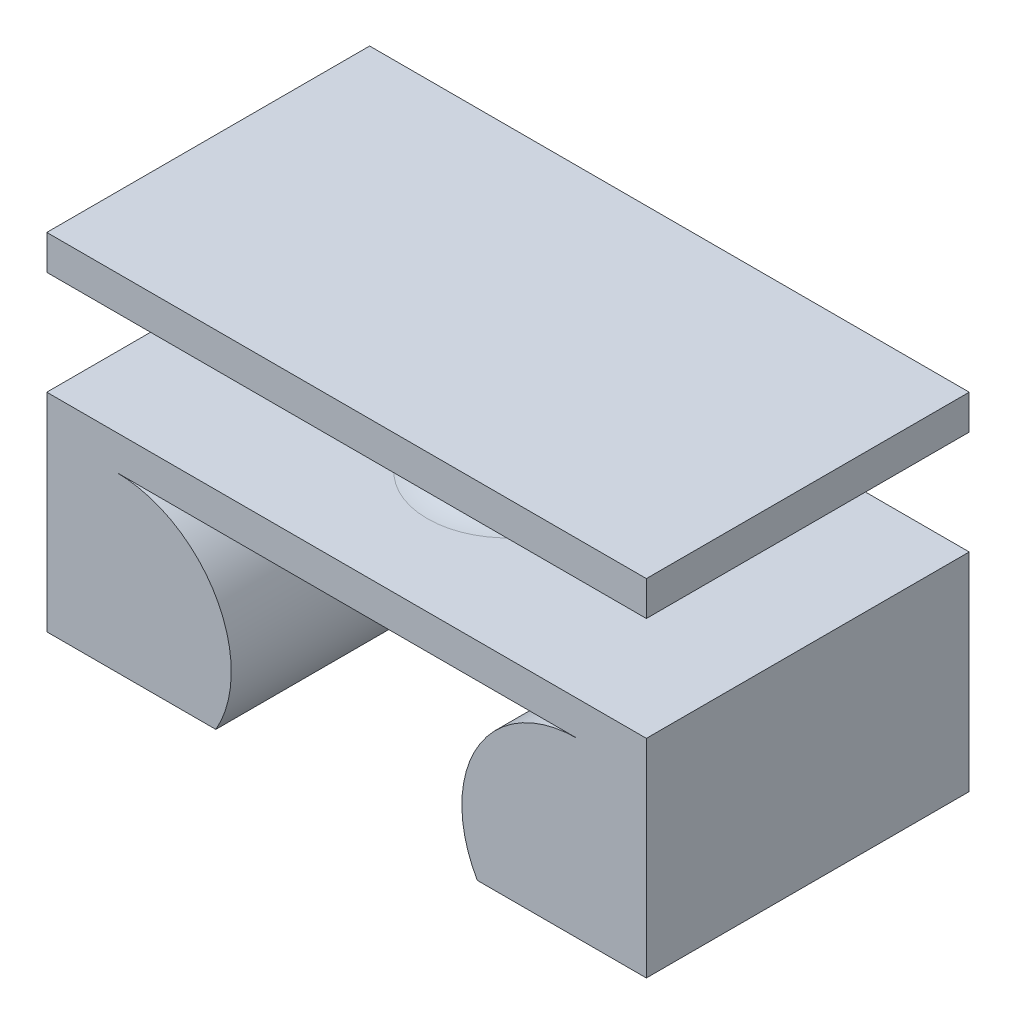
ISO-10303-21;
HEADER;
FILE_DESCRIPTION(('STEP AP214'),'2;1');
FILE_NAME('part.step','',(''),(''),'','','');
FILE_SCHEMA(('AUTOMOTIVE_DESIGN { 1 0 10303 214 1 1 1 1 }'));
ENDSEC;
DATA;
#1=APPLICATION_CONTEXT('core data for automotive mechanical design processes');
#2=APPLICATION_PROTOCOL_DEFINITION('international standard','automotive_design',2000,#1);
#3=PRODUCT_CONTEXT('',#1,'mechanical');
#4=PRODUCT('Part','Part','',(#3));
#5=PRODUCT_RELATED_PRODUCT_CATEGORY('part','',(#4));
#6=PRODUCT_DEFINITION_FORMATION('','',#4);
#7=PRODUCT_DEFINITION_CONTEXT('part definition',#1,'design');
#8=PRODUCT_DEFINITION('design','',#6,#7);
#9=PRODUCT_DEFINITION_SHAPE('','',#8);
#10=(LENGTH_UNIT() NAMED_UNIT(*) SI_UNIT(.MILLI.,.METRE.));
#11=(NAMED_UNIT(*) PLANE_ANGLE_UNIT() SI_UNIT($,.RADIAN.));
#12=(NAMED_UNIT(*) SI_UNIT($,.STERADIAN.) SOLID_ANGLE_UNIT());
#13=UNCERTAINTY_MEASURE_WITH_UNIT(LENGTH_MEASURE(1.E-05),#10,'distance_accuracy_value','');
#14=(GEOMETRIC_REPRESENTATION_CONTEXT(3) GLOBAL_UNCERTAINTY_ASSIGNED_CONTEXT((#13)) GLOBAL_UNIT_ASSIGNED_CONTEXT((#10,
#11,#12)) REPRESENTATION_CONTEXT('',''));
#15=CARTESIAN_POINT('',(0.,0.,0.));
#16=DIRECTION('',(0.,0.,1.));
#17=DIRECTION('',(1.,0.,0.));
#18=AXIS2_PLACEMENT_3D('',#15,#16,#17);
#19=CARTESIAN_POINT('',(5.00000000000001,-0.999999999999966,3.5));
#20=DIRECTION('',(0.,0.,-1.));
#21=DIRECTION('',(-1.,0.,0.));
#22=AXIS2_PLACEMENT_3D('',#19,#20,#21);
#23=CYLINDRICAL_SURFACE('',#22,2.49999999999998);
#24=CARTESIAN_POINT('',(5.00000000000001,-0.999999999999983,-5.));
#25=DIRECTION('',(-0.707106781186547,0.,-0.707106781186547));
#26=DIRECTION('',(0.707106781186547,0.,-0.707106781186547));
#27=AXIS2_PLACEMENT_3D('',#24,#25,#26);
#28=ELLIPSE('',#27,3.53553390593272,2.49999999999999);
#29=CARTESIAN_POINT('',(2.83493649053895,-2.25,-2.8349364905389));
#30=VERTEX_POINT('',#29);
#31=CARTESIAN_POINT('',(3.5,0.999999999999999,-3.5));
#32=VERTEX_POINT('',#31);
#33=EDGE_CURVE('E57',#30,#32,#28,.T.);
#34=ORIENTED_EDGE('',*,*,#33,.F.);
#35=DIRECTION('',(0.,0.,-1.));
#36=VECTOR('',#35,1.);
#37=CARTESIAN_POINT('',(2.83493649053895,-2.25,3.5));
#38=LINE('',#37,#36);
#39=CARTESIAN_POINT('',(2.83493649053895,-2.25,3.5));
#40=VERTEX_POINT('',#39);
#41=EDGE_CURVE('E50',#40,#30,#38,.T.);
#42=ORIENTED_EDGE('',*,*,#41,.F.);
#43=CARTESIAN_POINT('',(5.00000000000001,-0.999999999999966,3.5));
#44=DIRECTION('',(0.,0.,1.));
#45=DIRECTION('',(1.,0.,0.));
#46=AXIS2_PLACEMENT_3D('',#43,#44,#45);
#47=CIRCLE('',#46,2.49999999999998);
#48=CARTESIAN_POINT('',(5.,1.5,3.5));
#49=VERTEX_POINT('',#48);
#50=EDGE_CURVE('E178',#40,#49,#47,.F.);
#51=ORIENTED_EDGE('',*,*,#50,.T.);
#52=DIRECTION('',(0.,0.,-1.));
#53=VECTOR('',#52,1.);
#54=CARTESIAN_POINT('',(5.,1.5,3.5));
#55=LINE('',#54,#53);
#56=CARTESIAN_POINT('',(5.,1.5,-3.5));
#57=VERTEX_POINT('',#56);
#58=EDGE_CURVE('E197',#49,#57,#55,.T.);
#59=ORIENTED_EDGE('',*,*,#58,.T.);
#60=CARTESIAN_POINT('',(5.00000000000001,-0.999999999999966,-3.5));
#61=DIRECTION('',(0.,0.,1.));
#62=DIRECTION('',(1.,0.,0.));
#63=AXIS2_PLACEMENT_3D('',#60,#61,#62);
#64=CIRCLE('',#63,2.49999999999998);
#65=EDGE_CURVE('E177',#32,#57,#64,.F.);
#66=ORIENTED_EDGE('',*,*,#65,.F.);
#67=EDGE_LOOP('',(#34,#42,#51,#59,#66));
#68=FACE_BOUND('',#67,.T.);
#69=ADVANCED_FACE('F43',(#68),#23,.T.);
#70=CARTESIAN_POINT('',(6.5,0.,3.5));
#71=DIRECTION('',(1.,0.,0.));
#72=DIRECTION('',(0.,1.,0.));
#73=AXIS2_PLACEMENT_3D('',#70,#71,#72);
#74=PLANE('',#73);
#75=DIRECTION('',(0.,-1.,0.));
#76=VECTOR('',#75,1.);
#77=CARTESIAN_POINT('',(6.5,0.,-3.5));
#78=LINE('',#77,#76);
#79=CARTESIAN_POINT('',(6.5,2.25,-3.5));
#80=VERTEX_POINT('',#79);
#81=CARTESIAN_POINT('',(6.5,-2.25,-3.5));
#82=VERTEX_POINT('',#81);
#83=EDGE_CURVE('E199',#80,#82,#78,.T.);
#84=ORIENTED_EDGE('',*,*,#83,.F.);
#85=DIRECTION('',(0.,0.,-1.));
#86=VECTOR('',#85,1.);
#87=CARTESIAN_POINT('',(6.5,2.25,3.5));
#88=LINE('',#87,#86);
#89=CARTESIAN_POINT('',(6.5,2.25,3.5));
#90=VERTEX_POINT('',#89);
#91=EDGE_CURVE('E227',#90,#80,#88,.T.);
#92=ORIENTED_EDGE('',*,*,#91,.F.);
#93=DIRECTION('',(0.,-1.,0.));
#94=VECTOR('',#93,1.);
#95=CARTESIAN_POINT('',(6.5,0.,3.5));
#96=LINE('',#95,#94);
#97=CARTESIAN_POINT('',(6.5,-2.25,3.5));
#98=VERTEX_POINT('',#97);
#99=EDGE_CURVE('E185',#90,#98,#96,.T.);
#100=ORIENTED_EDGE('',*,*,#99,.T.);
#101=DIRECTION('',(0.,0.,-1.));
#102=VECTOR('',#101,1.);
#103=CARTESIAN_POINT('',(6.5,-2.25,3.5));
#104=LINE('',#103,#102);
#105=EDGE_CURVE('E229',#98,#82,#104,.T.);
#106=ORIENTED_EDGE('',*,*,#105,.T.);
#107=EDGE_LOOP('',(#84,#92,#100,#106));
#108=FACE_BOUND('',#107,.T.);
#109=ADVANCED_FACE('F263',(#108),#74,.T.);
#110=CARTESIAN_POINT('',(0.,2.25,3.5));
#111=DIRECTION('',(0.,-1.,0.));
#112=DIRECTION('',(1.,0.,0.));
#113=AXIS2_PLACEMENT_3D('',#110,#111,#112);
#114=PLANE('',#113);
#115=CARTESIAN_POINT('',(0.,2.25,0.));
#116=DIRECTION('',(0.,1.,0.));
#117=DIRECTION('',(-1.,0.,0.));
#118=AXIS2_PLACEMENT_3D('',#115,#116,#117);
#119=CIRCLE('',#118,1.75);
#120=CARTESIAN_POINT('',(-1.75,2.25,0.));
#121=VERTEX_POINT('',#120);
#122=EDGE_CURVE('E11',#121,#121,#119,.T.);
#123=ORIENTED_EDGE('',*,*,#122,.F.);
#124=EDGE_LOOP('',(#123));
#125=FACE_BOUND('',#124,.T.);
#126=DIRECTION('',(-1.,0.,0.));
#127=VECTOR('',#126,1.);
#128=CARTESIAN_POINT('',(0.,2.25,-3.5));
#129=LINE('',#128,#127);
#130=CARTESIAN_POINT('',(-6.5,2.25,-3.5));
#131=VERTEX_POINT('',#130);
#132=EDGE_CURVE('E206',#80,#131,#129,.T.);
#133=ORIENTED_EDGE('',*,*,#132,.T.);
#134=DIRECTION('',(0.,0.,-1.));
#135=VECTOR('',#134,1.);
#136=CARTESIAN_POINT('',(-6.5,2.25,3.5));
#137=LINE('',#136,#135);
#138=CARTESIAN_POINT('',(-6.5,2.25,3.5));
#139=VERTEX_POINT('',#138);
#140=EDGE_CURVE('E224',#139,#131,#137,.T.);
#141=ORIENTED_EDGE('',*,*,#140,.F.);
#142=DIRECTION('',(-1.,0.,0.));
#143=VECTOR('',#142,1.);
#144=CARTESIAN_POINT('',(0.,2.25,3.5));
#145=LINE('',#144,#143);
#146=EDGE_CURVE('E189',#90,#139,#145,.T.);
#147=ORIENTED_EDGE('',*,*,#146,.F.);
#148=ORIENTED_EDGE('',*,*,#91,.T.);
#149=EDGE_LOOP('',(#133,#141,#147,#148));
#150=FACE_BOUND('',#149,.T.);
#151=ADVANCED_FACE('F270',(#125,#150),#114,.F.);
#152=CARTESIAN_POINT('',(-6.5,0.,3.5));
#153=DIRECTION('',(1.,0.,0.));
#154=DIRECTION('',(0.,1.,0.));
#155=AXIS2_PLACEMENT_3D('',#152,#153,#154);
#156=PLANE('',#155);
#157=DIRECTION('',(0.,-1.,0.));
#158=VECTOR('',#157,1.);
#159=CARTESIAN_POINT('',(-6.5,0.,-3.5));
#160=LINE('',#159,#158);
#161=CARTESIAN_POINT('',(-6.5,-2.25,-3.5));
#162=VERTEX_POINT('',#161);
#163=EDGE_CURVE('E203',#131,#162,#160,.T.);
#164=ORIENTED_EDGE('',*,*,#163,.T.);
#165=DIRECTION('',(0.,0.,-1.));
#166=VECTOR('',#165,1.);
#167=CARTESIAN_POINT('',(-6.5,-2.25,3.5));
#168=LINE('',#167,#166);
#169=CARTESIAN_POINT('',(-6.5,-2.25,3.5));
#170=VERTEX_POINT('',#169);
#171=EDGE_CURVE('E221',#170,#162,#168,.T.);
#172=ORIENTED_EDGE('',*,*,#171,.F.);
#173=DIRECTION('',(0.,-1.,0.));
#174=VECTOR('',#173,1.);
#175=CARTESIAN_POINT('',(-6.5,0.,3.5));
#176=LINE('',#175,#174);
#177=EDGE_CURVE('E191',#139,#170,#176,.T.);
#178=ORIENTED_EDGE('',*,*,#177,.F.);
#179=ORIENTED_EDGE('',*,*,#140,.T.);
#180=EDGE_LOOP('',(#164,#172,#178,#179));
#181=FACE_BOUND('',#180,.T.);
#182=ADVANCED_FACE('F258',(#181),#156,.F.);
#183=CARTESIAN_POINT('',(0.,-2.25,3.5));
#184=DIRECTION('',(0.,-1.,0.));
#185=DIRECTION('',(1.,0.,0.));
#186=AXIS2_PLACEMENT_3D('',#183,#184,#185);
#187=PLANE('',#186);
#188=DIRECTION('',(1.,0.,0.));
#189=VECTOR('',#188,1.);
#190=CARTESIAN_POINT('',(-3.5,-2.25,-2.8349364905389));
#191=LINE('',#190,#189);
#192=CARTESIAN_POINT('',(-2.8349364905389,-2.25,-2.8349364905389));
#193=VERTEX_POINT('',#192);
#194=EDGE_CURVE('E170',#193,#30,#191,.T.);
#195=ORIENTED_EDGE('',*,*,#194,.F.);
#196=DIRECTION('',(0.,0.,-1.));
#197=VECTOR('',#196,1.);
#198=CARTESIAN_POINT('',(-2.8349364905389,-2.25,3.5));
#199=LINE('',#198,#197);
#200=CARTESIAN_POINT('',(-2.8349364905389,-2.25,3.5));
#201=VERTEX_POINT('',#200);
#202=EDGE_CURVE('E218',#201,#193,#199,.T.);
#203=ORIENTED_EDGE('',*,*,#202,.F.);
#204=DIRECTION('',(-1.,0.,0.));
#205=VECTOR('',#204,1.);
#206=CARTESIAN_POINT('',(0.,-2.25,3.5));
#207=LINE('',#206,#205);
#208=EDGE_CURVE('E186',#201,#170,#207,.T.);
#209=ORIENTED_EDGE('',*,*,#208,.T.);
#210=ORIENTED_EDGE('',*,*,#171,.T.);
#211=DIRECTION('',(-1.,0.,0.));
#212=VECTOR('',#211,1.);
#213=CARTESIAN_POINT('',(0.,-2.25,-3.5));
#214=LINE('',#213,#212);
#215=EDGE_CURVE('E200',#82,#162,#214,.T.);
#216=ORIENTED_EDGE('',*,*,#215,.F.);
#217=ORIENTED_EDGE('',*,*,#105,.F.);
#218=EDGE_CURVE('E181',#98,#40,#207,.T.);
#219=ORIENTED_EDGE('',*,*,#218,.T.);
#220=ORIENTED_EDGE('',*,*,#41,.T.);
#221=EDGE_LOOP('',(#195,#203,#209,#210,#216,#217,#219,#220));
#222=FACE_BOUND('',#221,.T.);
#223=ADVANCED_FACE('F233',(#222),#187,.T.);
#224=CARTESIAN_POINT('',(-5.,-1.,3.5));
#225=DIRECTION('',(0.,0.,-1.));
#226=DIRECTION('',(-1.,0.,0.));
#227=AXIS2_PLACEMENT_3D('',#224,#225,#226);
#228=CYLINDRICAL_SURFACE('',#227,2.5);
#229=ORIENTED_EDGE('',*,*,#202,.T.);
#230=CARTESIAN_POINT('',(-5.,-1.,-5.));
#231=DIRECTION('',(0.707106781186547,0.,-0.707106781186547));
#232=DIRECTION('',(-0.707106781186547,0.,-0.707106781186547));
#233=AXIS2_PLACEMENT_3D('',#230,#231,#232);
#234=ELLIPSE('',#233,3.53553390593274,2.5);
#235=CARTESIAN_POINT('',(-3.5,1.,-3.5));
#236=VERTEX_POINT('',#235);
#237=EDGE_CURVE('E173',#193,#236,#234,.F.);
#238=ORIENTED_EDGE('',*,*,#237,.T.);
#239=CARTESIAN_POINT('',(-5.,-1.,-3.5));
#240=DIRECTION('',(0.,0.,1.));
#241=DIRECTION('',(1.,0.,0.));
#242=AXIS2_PLACEMENT_3D('',#239,#240,#241);
#243=CIRCLE('',#242,2.5);
#244=CARTESIAN_POINT('',(-5.,1.5,-3.5));
#245=VERTEX_POINT('',#244);
#246=EDGE_CURVE('E202',#236,#245,#243,.T.);
#247=ORIENTED_EDGE('',*,*,#246,.T.);
#248=DIRECTION('',(0.,0.,-1.));
#249=VECTOR('',#248,1.);
#250=CARTESIAN_POINT('',(-5.,1.5,3.5));
#251=LINE('',#250,#249);
#252=CARTESIAN_POINT('',(-5.,1.5,3.5));
#253=VERTEX_POINT('',#252);
#254=EDGE_CURVE('E215',#253,#245,#251,.T.);
#255=ORIENTED_EDGE('',*,*,#254,.F.);
#256=CARTESIAN_POINT('',(-5.,-1.,3.5));
#257=DIRECTION('',(0.,0.,1.));
#258=DIRECTION('',(1.,0.,0.));
#259=AXIS2_PLACEMENT_3D('',#256,#257,#258);
#260=CIRCLE('',#259,2.5);
#261=EDGE_CURVE('E193',#201,#253,#260,.T.);
#262=ORIENTED_EDGE('',*,*,#261,.F.);
#263=EDGE_LOOP('',(#229,#238,#247,#255,#262));
#264=FACE_BOUND('',#263,.T.);
#265=ADVANCED_FACE('F239',(#264),#228,.T.);
#266=CARTESIAN_POINT('',(0.,1.5,3.5));
#267=DIRECTION('',(0.,1.,0.));
#268=DIRECTION('',(0.,0.,1.));
#269=AXIS2_PLACEMENT_3D('',#266,#267,#268);
#270=PLANE('',#269);
#271=DIRECTION('',(1.,0.,0.));
#272=VECTOR('',#271,1.);
#273=CARTESIAN_POINT('',(0.,1.5,-3.5));
#274=LINE('',#273,#272);
#275=EDGE_CURVE('E182',#245,#57,#274,.T.);
#276=ORIENTED_EDGE('',*,*,#275,.T.);
#277=ORIENTED_EDGE('',*,*,#58,.F.);
#278=DIRECTION('',(1.,0.,0.));
#279=VECTOR('',#278,1.);
#280=CARTESIAN_POINT('',(0.,1.5,3.5));
#281=LINE('',#280,#279);
#282=EDGE_CURVE('E195',#253,#49,#281,.T.);
#283=ORIENTED_EDGE('',*,*,#282,.F.);
#284=ORIENTED_EDGE('',*,*,#254,.T.);
#285=EDGE_LOOP('',(#276,#277,#283,#284));
#286=FACE_BOUND('',#285,.T.);
#287=ADVANCED_FACE('F248',(#286),#270,.F.);
#288=CARTESIAN_POINT('',(0.,0.,3.5));
#289=DIRECTION('',(0.,0.,1.));
#290=DIRECTION('',(1.,0.,0.));
#291=AXIS2_PLACEMENT_3D('',#288,#289,#290);
#292=PLANE('',#291);
#293=ORIENTED_EDGE('',*,*,#50,.F.);
#294=ORIENTED_EDGE('',*,*,#218,.F.);
#295=ORIENTED_EDGE('',*,*,#99,.F.);
#296=ORIENTED_EDGE('',*,*,#146,.T.);
#297=ORIENTED_EDGE('',*,*,#177,.T.);
#298=ORIENTED_EDGE('',*,*,#208,.F.);
#299=ORIENTED_EDGE('',*,*,#261,.T.);
#300=ORIENTED_EDGE('',*,*,#282,.T.);
#301=EDGE_LOOP('',(#293,#294,#295,#296,#297,#298,#299,#300));
#302=FACE_BOUND('',#301,.T.);
#303=ADVANCED_FACE('F253',(#302),#292,.T.);
#304=CARTESIAN_POINT('',(0.,0.,-3.5));
#305=DIRECTION('',(0.,0.,1.));
#306=DIRECTION('',(1.,0.,0.));
#307=AXIS2_PLACEMENT_3D('',#304,#305,#306);
#308=PLANE('',#307);
#309=DIRECTION('',(1.,0.,0.));
#310=VECTOR('',#309,1.);
#311=CARTESIAN_POINT('',(-3.5,0.999999999999999,-3.5));
#312=LINE('',#311,#310);
#313=EDGE_CURVE('E64',#236,#32,#312,.T.);
#314=ORIENTED_EDGE('',*,*,#313,.T.);
#315=ORIENTED_EDGE('',*,*,#65,.T.);
#316=ORIENTED_EDGE('',*,*,#275,.F.);
#317=ORIENTED_EDGE('',*,*,#246,.F.);
#318=EDGE_LOOP('',(#314,#315,#316,#317));
#319=FACE_BOUND('',#318,.T.);
#320=ORIENTED_EDGE('',*,*,#215,.T.);
#321=ORIENTED_EDGE('',*,*,#163,.F.);
#322=ORIENTED_EDGE('',*,*,#132,.F.);
#323=ORIENTED_EDGE('',*,*,#83,.T.);
#324=EDGE_LOOP('',(#320,#321,#322,#323));
#325=FACE_BOUND('',#324,.T.);
#326=ADVANCED_FACE('F244',(#319,#325),#308,.F.);
#327=CARTESIAN_POINT('',(-3.5,-1.,-5.));
#328=DIRECTION('',(1.,0.,0.));
#329=DIRECTION('',(0.,0.,-1.));
#330=AXIS2_PLACEMENT_3D('',#327,#328,#329);
#331=CYLINDRICAL_SURFACE('',#330,2.5);
#332=ORIENTED_EDGE('',*,*,#194,.T.);
#333=ORIENTED_EDGE('',*,*,#33,.T.);
#334=ORIENTED_EDGE('',*,*,#313,.F.);
#335=ORIENTED_EDGE('',*,*,#237,.F.);
#336=EDGE_LOOP('',(#332,#333,#334,#335));
#337=FACE_BOUND('',#336,.T.);
#338=ADVANCED_FACE('F236',(#337),#331,.T.);
#339=CARTESIAN_POINT('',(0.,3.375,0.));
#340=DIRECTION('',(0.,1.,0.));
#341=DIRECTION('',(-1.,0.,0.));
#342=AXIS2_PLACEMENT_3D('',#339,#340,#341);
#343=TOROIDAL_SURFACE('',#342,1.75,1.125);
#344=CARTESIAN_POINT('',(0.,4.5,0.));
#345=DIRECTION('',(0.,1.,0.));
#346=DIRECTION('',(-1.,0.,0.));
#347=AXIS2_PLACEMENT_3D('',#344,#345,#346);
#348=CIRCLE('',#347,1.75);
#349=CARTESIAN_POINT('',(-1.75,4.5,0.));
#350=VERTEX_POINT('',#349);
#351=EDGE_CURVE('E162',#350,#350,#348,.T.);
#352=ORIENTED_EDGE('',*,*,#351,.F.);
#353=EDGE_LOOP('',(#352));
#354=FACE_BOUND('',#353,.T.);
#355=ORIENTED_EDGE('',*,*,#122,.T.);
#356=EDGE_LOOP('',(#355));
#357=FACE_BOUND('',#356,.T.);
#358=ADVANCED_FACE('F291',(#354,#357),#343,.F.);
#359=CARTESIAN_POINT('',(6.5,5.25,3.5));
#360=DIRECTION('',(-1.,0.,0.));
#361=DIRECTION('',(0.,-1.,0.));
#362=AXIS2_PLACEMENT_3D('',#359,#360,#361);
#363=PLANE('',#362);
#364=DIRECTION('',(0.,0.,-1.));
#365=VECTOR('',#364,1.);
#366=CARTESIAN_POINT('',(6.5,4.5,3.5));
#367=LINE('',#366,#365);
#368=CARTESIAN_POINT('',(6.5,4.5,3.5));
#369=VERTEX_POINT('',#368);
#370=CARTESIAN_POINT('',(6.5,4.5,-3.5));
#371=VERTEX_POINT('',#370);
#372=EDGE_CURVE('E161',#369,#371,#367,.T.);
#373=ORIENTED_EDGE('',*,*,#372,.T.);
#374=DIRECTION('',(0.,-1.,0.));
#375=VECTOR('',#374,1.);
#376=CARTESIAN_POINT('',(6.5,5.25,-3.5));
#377=LINE('',#376,#375);
#378=CARTESIAN_POINT('',(6.5,5.25,-3.5));
#379=VERTEX_POINT('',#378);
#380=EDGE_CURVE('E141',#379,#371,#377,.T.);
#381=ORIENTED_EDGE('',*,*,#380,.F.);
#382=DIRECTION('',(0.,0.,-1.));
#383=VECTOR('',#382,1.);
#384=CARTESIAN_POINT('',(6.5,5.25,3.5));
#385=LINE('',#384,#383);
#386=CARTESIAN_POINT('',(6.5,5.25,3.5));
#387=VERTEX_POINT('',#386);
#388=EDGE_CURVE('E148',#387,#379,#385,.T.);
#389=ORIENTED_EDGE('',*,*,#388,.F.);
#390=DIRECTION('',(0.,-1.,0.));
#391=VECTOR('',#390,1.);
#392=CARTESIAN_POINT('',(6.5,5.25,3.5));
#393=LINE('',#392,#391);
#394=EDGE_CURVE('E432',#387,#369,#393,.T.);
#395=ORIENTED_EDGE('',*,*,#394,.T.);
#396=EDGE_LOOP('',(#373,#381,#389,#395));
#397=FACE_BOUND('',#396,.T.);
#398=ADVANCED_FACE('F159',(#397),#363,.F.);
#399=CARTESIAN_POINT('',(6.5,5.25,-3.5));
#400=DIRECTION('',(0.,0.,1.));
#401=DIRECTION('',(1.,0.,0.));
#402=AXIS2_PLACEMENT_3D('',#399,#400,#401);
#403=PLANE('',#402);
#404=DIRECTION('',(-1.,0.,0.));
#405=VECTOR('',#404,1.);
#406=CARTESIAN_POINT('',(6.5,4.5,-3.5));
#407=LINE('',#406,#405);
#408=CARTESIAN_POINT('',(-6.5,4.5,-3.5));
#409=VERTEX_POINT('',#408);
#410=EDGE_CURVE('E423',#371,#409,#407,.T.);
#411=ORIENTED_EDGE('',*,*,#410,.T.);
#412=DIRECTION('',(0.,-1.,0.));
#413=VECTOR('',#412,1.);
#414=CARTESIAN_POINT('',(-6.5,5.25,-3.5));
#415=LINE('',#414,#413);
#416=CARTESIAN_POINT('',(-6.5,5.25,-3.5));
#417=VERTEX_POINT('',#416);
#418=EDGE_CURVE('E144',#417,#409,#415,.T.);
#419=ORIENTED_EDGE('',*,*,#418,.F.);
#420=DIRECTION('',(-1.,0.,0.));
#421=VECTOR('',#420,1.);
#422=CARTESIAN_POINT('',(6.5,5.25,-3.5));
#423=LINE('',#422,#421);
#424=EDGE_CURVE('E137',#379,#417,#423,.T.);
#425=ORIENTED_EDGE('',*,*,#424,.F.);
#426=ORIENTED_EDGE('',*,*,#380,.T.);
#427=EDGE_LOOP('',(#411,#419,#425,#426));
#428=FACE_BOUND('',#427,.T.);
#429=ADVANCED_FACE('F139',(#428),#403,.F.);
#430=CARTESIAN_POINT('',(-6.5,5.25,-3.5));
#431=DIRECTION('',(1.,0.,0.));
#432=DIRECTION('',(0.,1.,0.));
#433=AXIS2_PLACEMENT_3D('',#430,#431,#432);
#434=PLANE('',#433);
#435=DIRECTION('',(0.,0.,1.));
#436=VECTOR('',#435,1.);
#437=CARTESIAN_POINT('',(-6.5,4.5,-3.5));
#438=LINE('',#437,#436);
#439=CARTESIAN_POINT('',(-6.5,4.5,3.5));
#440=VERTEX_POINT('',#439);
#441=EDGE_CURVE('E425',#409,#440,#438,.T.);
#442=ORIENTED_EDGE('',*,*,#441,.T.);
#443=DIRECTION('',(0.,-1.,0.));
#444=VECTOR('',#443,1.);
#445=CARTESIAN_POINT('',(-6.5,5.25,3.5));
#446=LINE('',#445,#444);
#447=CARTESIAN_POINT('',(-6.5,5.25,3.5));
#448=VERTEX_POINT('',#447);
#449=EDGE_CURVE('E166',#448,#440,#446,.T.);
#450=ORIENTED_EDGE('',*,*,#449,.F.);
#451=DIRECTION('',(0.,0.,1.));
#452=VECTOR('',#451,1.);
#453=CARTESIAN_POINT('',(-6.5,5.25,-3.5));
#454=LINE('',#453,#452);
#455=EDGE_CURVE('E147',#417,#448,#454,.T.);
#456=ORIENTED_EDGE('',*,*,#455,.F.);
#457=ORIENTED_EDGE('',*,*,#418,.T.);
#458=EDGE_LOOP('',(#442,#450,#456,#457));
#459=FACE_BOUND('',#458,.T.);
#460=ADVANCED_FACE('F299',(#459),#434,.F.);
#461=CARTESIAN_POINT('',(-6.5,5.25,3.5));
#462=DIRECTION('',(0.,0.,-1.));
#463=DIRECTION('',(-1.,0.,0.));
#464=AXIS2_PLACEMENT_3D('',#461,#462,#463);
#465=PLANE('',#464);
#466=DIRECTION('',(1.,0.,0.));
#467=VECTOR('',#466,1.);
#468=CARTESIAN_POINT('',(-6.5,4.5,3.5));
#469=LINE('',#468,#467);
#470=EDGE_CURVE('E157',#440,#369,#469,.T.);
#471=ORIENTED_EDGE('',*,*,#470,.T.);
#472=ORIENTED_EDGE('',*,*,#394,.F.);
#473=DIRECTION('',(1.,0.,0.));
#474=VECTOR('',#473,1.);
#475=CARTESIAN_POINT('',(-6.5,5.25,3.5));
#476=LINE('',#475,#474);
#477=EDGE_CURVE('E153',#448,#387,#476,.T.);
#478=ORIENTED_EDGE('',*,*,#477,.F.);
#479=ORIENTED_EDGE('',*,*,#449,.T.);
#480=EDGE_LOOP('',(#471,#472,#478,#479));
#481=FACE_BOUND('',#480,.T.);
#482=ADVANCED_FACE('F302',(#481),#465,.F.);
#483=CARTESIAN_POINT('',(0.,5.25,0.));
#484=DIRECTION('',(0.,1.,0.));
#485=DIRECTION('',(-1.,0.,0.));
#486=AXIS2_PLACEMENT_3D('',#483,#484,#485);
#487=PLANE('',#486);
#488=ORIENTED_EDGE('',*,*,#388,.T.);
#489=ORIENTED_EDGE('',*,*,#424,.T.);
#490=ORIENTED_EDGE('',*,*,#455,.T.);
#491=ORIENTED_EDGE('',*,*,#477,.T.);
#492=EDGE_LOOP('',(#488,#489,#490,#491));
#493=FACE_BOUND('',#492,.T.);
#494=ADVANCED_FACE('F151',(#493),#487,.T.);
#495=CARTESIAN_POINT('',(0.,4.5,0.));
#496=DIRECTION('',(0.,1.,0.));
#497=DIRECTION('',(-1.,0.,0.));
#498=AXIS2_PLACEMENT_3D('',#495,#496,#497);
#499=PLANE('',#498);
#500=ORIENTED_EDGE('',*,*,#351,.T.);
#501=EDGE_LOOP('',(#500));
#502=FACE_BOUND('',#501,.T.);
#503=ORIENTED_EDGE('',*,*,#372,.F.);
#504=ORIENTED_EDGE('',*,*,#470,.F.);
#505=ORIENTED_EDGE('',*,*,#441,.F.);
#506=ORIENTED_EDGE('',*,*,#410,.F.);
#507=EDGE_LOOP('',(#503,#504,#505,#506));
#508=FACE_BOUND('',#507,.T.);
#509=ADVANCED_FACE('F307',(#502,#508),#499,.F.);
#510=CLOSED_SHELL('',(#69,#109,#151,#182,#223,#265,#287,#303,#326,#338,#358,#398,#429,#460,#482,
#494,#509));
#511=MANIFOLD_SOLID_BREP('B2',#510);
#512=ADVANCED_BREP_SHAPE_REPRESENTATION('',(#18,#511),#14);
#513=SHAPE_DEFINITION_REPRESENTATION(#9,#512);
ENDSEC;
END-ISO-10303-21;
